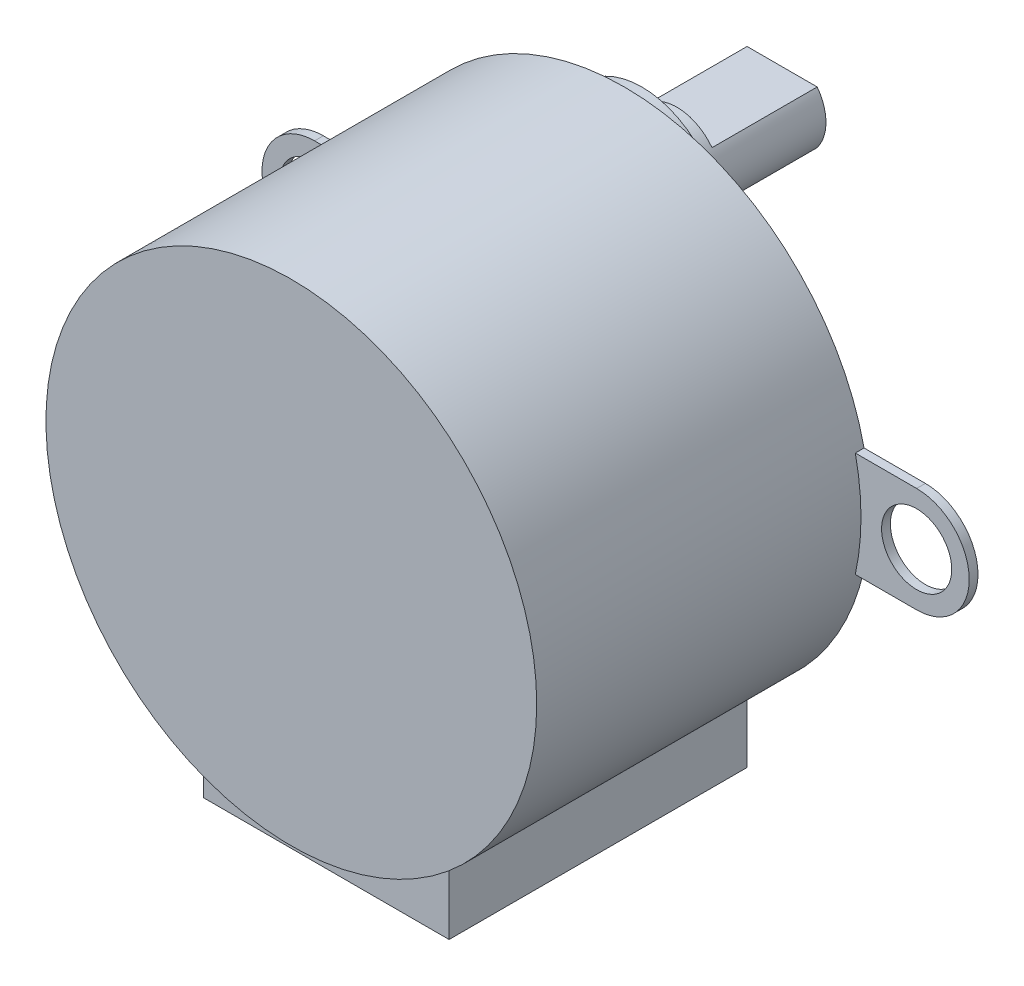
ISO-10303-21;
HEADER;
FILE_DESCRIPTION(('STEP AP214'),'2;1');
FILE_NAME('part.step','',(''),(''),'','','');
FILE_SCHEMA(('AUTOMOTIVE_DESIGN { 1 0 10303 214 1 1 1 1 }'));
ENDSEC;
DATA;
#1=APPLICATION_CONTEXT('core data for automotive mechanical design processes');
#2=APPLICATION_PROTOCOL_DEFINITION('international standard','automotive_design',2000,#1);
#3=PRODUCT_CONTEXT('',#1,'mechanical');
#4=PRODUCT('Part','Part','',(#3));
#5=PRODUCT_RELATED_PRODUCT_CATEGORY('part','',(#4));
#6=PRODUCT_DEFINITION_FORMATION('','',#4);
#7=PRODUCT_DEFINITION_CONTEXT('part definition',#1,'design');
#8=PRODUCT_DEFINITION('design','',#6,#7);
#9=PRODUCT_DEFINITION_SHAPE('','',#8);
#10=(LENGTH_UNIT() NAMED_UNIT(*) SI_UNIT(.MILLI.,.METRE.));
#11=(NAMED_UNIT(*) PLANE_ANGLE_UNIT() SI_UNIT($,.RADIAN.));
#12=(NAMED_UNIT(*) SI_UNIT($,.STERADIAN.) SOLID_ANGLE_UNIT());
#13=UNCERTAINTY_MEASURE_WITH_UNIT(LENGTH_MEASURE(1.E-05),#10,'distance_accuracy_value','');
#14=(GEOMETRIC_REPRESENTATION_CONTEXT(3) GLOBAL_UNCERTAINTY_ASSIGNED_CONTEXT((#13)) GLOBAL_UNIT_ASSIGNED_CONTEXT((#10,
#11,#12)) REPRESENTATION_CONTEXT('',''));
#15=CARTESIAN_POINT('',(0.,0.,0.));
#16=DIRECTION('',(0.,0.,1.));
#17=DIRECTION('',(1.,0.,0.));
#18=AXIS2_PLACEMENT_3D('',#15,#16,#17);
#19=CARTESIAN_POINT('',(0.,9.,-3.));
#20=DIRECTION('',(0.,0.,-1.));
#21=DIRECTION('',(-1.,0.,0.));
#22=AXIS2_PLACEMENT_3D('',#19,#20,#21);
#23=PLANE('',#22);
#24=DIRECTION('',(1.,0.,0.));
#25=VECTOR('',#24,1.);
#26=CARTESIAN_POINT('',(2.,10.5,-3.));
#27=LINE('',#26,#25);
#28=CARTESIAN_POINT('',(-2.,10.5,-3.));
#29=VERTEX_POINT('',#28);
#30=CARTESIAN_POINT('',(2.,10.5,-3.));
#31=VERTEX_POINT('',#30);
#32=EDGE_CURVE('E188',#29,#31,#27,.T.);
#33=ORIENTED_EDGE('',*,*,#32,.F.);
#34=CARTESIAN_POINT('',(0.,9.,-3.));
#35=DIRECTION('',(0.,0.,-1.));
#36=DIRECTION('',(-1.,0.,0.));
#37=AXIS2_PLACEMENT_3D('',#34,#35,#36);
#38=CIRCLE('',#37,2.5);
#39=EDGE_CURVE('E211',#29,#31,#38,.T.);
#40=ORIENTED_EDGE('',*,*,#39,.T.);
#41=EDGE_LOOP('',(#33,#40));
#42=FACE_BOUND('',#41,.T.);
#43=ADVANCED_FACE('F39',(#42),#23,.T.);
#44=CARTESIAN_POINT('',(0.,0.,19.));
#45=DIRECTION('',(0.,0.,-1.));
#46=DIRECTION('',(-1.,0.,0.));
#47=AXIS2_PLACEMENT_3D('',#44,#45,#46);
#48=CYLINDRICAL_SURFACE('',#47,14.);
#49=CARTESIAN_POINT('',(0.,0.,19.));
#50=DIRECTION('',(0.,0.,1.));
#51=DIRECTION('',(1.,0.,0.));
#52=AXIS2_PLACEMENT_3D('',#49,#50,#51);
#53=CIRCLE('',#52,14.);
#54=CARTESIAN_POINT('',(14.,0.,19.));
#55=VERTEX_POINT('',#54);
#56=EDGE_CURVE('E292',#55,#55,#53,.T.);
#57=ORIENTED_EDGE('',*,*,#56,.F.);
#58=EDGE_LOOP('',(#57));
#59=FACE_BOUND('',#58,.T.);
#60=CARTESIAN_POINT('',(0.,0.,17.));
#61=DIRECTION('',(0.,0.,1.));
#62=DIRECTION('',(1.,0.,0.));
#63=AXIS2_PLACEMENT_3D('',#60,#61,#62);
#64=CIRCLE('',#63,14.);
#65=CARTESIAN_POINT('',(-7.,-12.1243556529821,17.));
#66=VERTEX_POINT('',#65);
#67=CARTESIAN_POINT('',(7.,-12.1243556529821,17.));
#68=VERTEX_POINT('',#67);
#69=EDGE_CURVE('E11',#66,#68,#64,.T.);
#70=ORIENTED_EDGE('',*,*,#69,.T.);
#71=DIRECTION('',(0.,0.,-1.));
#72=VECTOR('',#71,1.);
#73=CARTESIAN_POINT('',(7.,-12.1243556529821,17.));
#74=LINE('',#73,#72);
#75=CARTESIAN_POINT('',(7.,-12.1243556529821,0.));
#76=VERTEX_POINT('',#75);
#77=EDGE_CURVE('E170',#68,#76,#74,.T.);
#78=ORIENTED_EDGE('',*,*,#77,.T.);
#79=CARTESIAN_POINT('',(0.,0.,0.));
#80=DIRECTION('',(0.,0.,1.));
#81=DIRECTION('',(1.,0.,0.));
#82=AXIS2_PLACEMENT_3D('',#79,#80,#81);
#83=CIRCLE('',#82,14.);
#84=CARTESIAN_POINT('',(13.6747943311773,-3.,0.));
#85=VERTEX_POINT('',#84);
#86=EDGE_CURVE('E296',#76,#85,#83,.T.);
#87=ORIENTED_EDGE('',*,*,#86,.T.);
#88=DIRECTION('',(0.,0.,-1.));
#89=VECTOR('',#88,1.);
#90=CARTESIAN_POINT('',(13.6747943311773,-3.,0.5));
#91=LINE('',#90,#89);
#92=CARTESIAN_POINT('',(13.6747943311773,-3.,0.5));
#93=VERTEX_POINT('',#92);
#94=EDGE_CURVE('E252',#93,#85,#91,.T.);
#95=ORIENTED_EDGE('',*,*,#94,.F.);
#96=CARTESIAN_POINT('',(0.,0.,0.5));
#97=DIRECTION('',(0.,0.,1.));
#98=DIRECTION('',(-1.,0.,0.));
#99=AXIS2_PLACEMENT_3D('',#96,#97,#98);
#100=CIRCLE('',#99,14.);
#101=CARTESIAN_POINT('',(13.6747943311773,3.,0.5));
#102=VERTEX_POINT('',#101);
#103=EDGE_CURVE('E233',#93,#102,#100,.T.);
#104=ORIENTED_EDGE('',*,*,#103,.T.);
#105=DIRECTION('',(0.,0.,-1.));
#106=VECTOR('',#105,1.);
#107=CARTESIAN_POINT('',(13.6747943311773,3.,0.5));
#108=LINE('',#107,#106);
#109=CARTESIAN_POINT('',(13.6747943311773,3.,0.));
#110=VERTEX_POINT('',#109);
#111=EDGE_CURVE('E249',#102,#110,#108,.T.);
#112=ORIENTED_EDGE('',*,*,#111,.T.);
#113=CARTESIAN_POINT('',(-13.6747943311773,3.,0.));
#114=VERTEX_POINT('',#113);
#115=EDGE_CURVE('E284',#110,#114,#83,.T.);
#116=ORIENTED_EDGE('',*,*,#115,.T.);
#117=DIRECTION('',(0.,0.,-1.));
#118=VECTOR('',#117,1.);
#119=CARTESIAN_POINT('',(-13.6747943311773,3.,0.5));
#120=LINE('',#119,#118);
#121=CARTESIAN_POINT('',(-13.6747943311773,3.,0.5));
#122=VERTEX_POINT('',#121);
#123=EDGE_CURVE('E288',#122,#114,#120,.T.);
#124=ORIENTED_EDGE('',*,*,#123,.F.);
#125=CARTESIAN_POINT('',(0.,0.,0.5));
#126=DIRECTION('',(0.,0.,1.));
#127=DIRECTION('',(-1.,0.,0.));
#128=AXIS2_PLACEMENT_3D('',#125,#126,#127);
#129=CIRCLE('',#128,14.);
#130=CARTESIAN_POINT('',(-13.6747943311773,-3.,0.5));
#131=VERTEX_POINT('',#130);
#132=EDGE_CURVE('E269',#122,#131,#129,.T.);
#133=ORIENTED_EDGE('',*,*,#132,.T.);
#134=DIRECTION('',(0.,0.,-1.));
#135=VECTOR('',#134,1.);
#136=CARTESIAN_POINT('',(-13.6747943311773,-3.00000000000001,0.5));
#137=LINE('',#136,#135);
#138=CARTESIAN_POINT('',(-13.6747943311773,-3.00000000000001,0.));
#139=VERTEX_POINT('',#138);
#140=EDGE_CURVE('E285',#131,#139,#137,.T.);
#141=ORIENTED_EDGE('',*,*,#140,.T.);
#142=CARTESIAN_POINT('',(-7.,-12.1243556529821,0.));
#143=VERTEX_POINT('',#142);
#144=EDGE_CURVE('E295',#139,#143,#83,.T.);
#145=ORIENTED_EDGE('',*,*,#144,.T.);
#146=DIRECTION('',(0.,0.,-1.));
#147=VECTOR('',#146,1.);
#148=CARTESIAN_POINT('',(-7.,-12.1243556529821,17.));
#149=LINE('',#148,#147);
#150=EDGE_CURVE('E57',#66,#143,#149,.T.);
#151=ORIENTED_EDGE('',*,*,#150,.F.);
#152=EDGE_LOOP('',(#70,#78,#87,#95,#104,#112,#116,#124,#133,#141,#145,#151));
#153=FACE_BOUND('',#152,.T.);
#154=ADVANCED_FACE('F41',(#59,#153),#48,.T.);
#155=CARTESIAN_POINT('',(0.,0.,19.));
#156=DIRECTION('',(0.,0.,1.));
#157=DIRECTION('',(1.,0.,0.));
#158=AXIS2_PLACEMENT_3D('',#155,#156,#157);
#159=PLANE('',#158);
#160=ORIENTED_EDGE('',*,*,#56,.T.);
#161=EDGE_LOOP('',(#160));
#162=FACE_BOUND('',#161,.T.);
#163=ADVANCED_FACE('F306',(#162),#159,.T.);
#164=CARTESIAN_POINT('',(0.,0.,0.));
#165=DIRECTION('',(0.,0.,1.));
#166=DIRECTION('',(1.,0.,0.));
#167=AXIS2_PLACEMENT_3D('',#164,#165,#166);
#168=PLANE('',#167);
#169=CARTESIAN_POINT('',(0.,9.,0.));
#170=DIRECTION('',(0.,0.,1.));
#171=DIRECTION('',(1.,0.,0.));
#172=AXIS2_PLACEMENT_3D('',#169,#170,#171);
#173=CIRCLE('',#172,4.5);
#174=CARTESIAN_POINT('',(4.5,9.,0.));
#175=VERTEX_POINT('',#174);
#176=EDGE_CURVE('E216',#175,#175,#173,.F.);
#177=ORIENTED_EDGE('',*,*,#176,.F.);
#178=EDGE_LOOP('',(#177));
#179=FACE_BOUND('',#178,.T.);
#180=ORIENTED_EDGE('',*,*,#86,.F.);
#181=DIRECTION('',(0.,-1.,0.));
#182=VECTOR('',#181,1.);
#183=CARTESIAN_POINT('',(7.,-16.1243556529821,0.));
#184=LINE('',#183,#182);
#185=CARTESIAN_POINT('',(7.,-16.1243556529821,0.));
#186=VERTEX_POINT('',#185);
#187=EDGE_CURVE('E177',#76,#186,#184,.T.);
#188=ORIENTED_EDGE('',*,*,#187,.T.);
#189=DIRECTION('',(-1.,0.,0.));
#190=VECTOR('',#189,1.);
#191=CARTESIAN_POINT('',(7.,-16.1243556529821,0.));
#192=LINE('',#191,#190);
#193=CARTESIAN_POINT('',(-7.,-16.1243556529821,0.));
#194=VERTEX_POINT('',#193);
#195=EDGE_CURVE('E154',#186,#194,#192,.T.);
#196=ORIENTED_EDGE('',*,*,#195,.T.);
#197=DIRECTION('',(0.,1.,0.));
#198=VECTOR('',#197,1.);
#199=CARTESIAN_POINT('',(-7.,-16.1243556529821,0.));
#200=LINE('',#199,#198);
#201=EDGE_CURVE('E171',#194,#143,#200,.T.);
#202=ORIENTED_EDGE('',*,*,#201,.T.);
#203=ORIENTED_EDGE('',*,*,#144,.F.);
#204=DIRECTION('',(-1.,0.,0.));
#205=VECTOR('',#204,1.);
#206=CARTESIAN_POINT('',(-17.1747943311773,-3.,0.));
#207=LINE('',#206,#205);
#208=CARTESIAN_POINT('',(-17.1747943311773,-3.,0.));
#209=VERTEX_POINT('',#208);
#210=EDGE_CURVE('E266',#139,#209,#207,.T.);
#211=ORIENTED_EDGE('',*,*,#210,.T.);
#212=CARTESIAN_POINT('',(-17.1747943311773,0.,0.));
#213=DIRECTION('',(0.,0.,-1.));
#214=DIRECTION('',(-1.,0.,0.));
#215=AXIS2_PLACEMENT_3D('',#212,#213,#214);
#216=CIRCLE('',#215,3.);
#217=CARTESIAN_POINT('',(-17.1747943311773,3.,0.));
#218=VERTEX_POINT('',#217);
#219=EDGE_CURVE('E259',#209,#218,#216,.T.);
#220=ORIENTED_EDGE('',*,*,#219,.T.);
#221=DIRECTION('',(1.,0.,0.));
#222=VECTOR('',#221,1.);
#223=CARTESIAN_POINT('',(-17.1747943311773,3.,0.));
#224=LINE('',#223,#222);
#225=EDGE_CURVE('E277',#218,#114,#224,.T.);
#226=ORIENTED_EDGE('',*,*,#225,.T.);
#227=ORIENTED_EDGE('',*,*,#115,.F.);
#228=DIRECTION('',(1.,0.,0.));
#229=VECTOR('',#228,1.);
#230=CARTESIAN_POINT('',(17.1747943311773,3.,0.));
#231=LINE('',#230,#229);
#232=CARTESIAN_POINT('',(17.1747943311773,3.,0.));
#233=VERTEX_POINT('',#232);
#234=EDGE_CURVE('E230',#110,#233,#231,.T.);
#235=ORIENTED_EDGE('',*,*,#234,.T.);
#236=CARTESIAN_POINT('',(17.1747943311773,0.,0.));
#237=DIRECTION('',(0.,0.,-1.));
#238=DIRECTION('',(1.,0.,0.));
#239=AXIS2_PLACEMENT_3D('',#236,#237,#238);
#240=CIRCLE('',#239,3.);
#241=CARTESIAN_POINT('',(17.1747943311773,-3.,0.));
#242=VERTEX_POINT('',#241);
#243=EDGE_CURVE('E223',#233,#242,#240,.T.);
#244=ORIENTED_EDGE('',*,*,#243,.T.);
#245=DIRECTION('',(-1.,0.,0.));
#246=VECTOR('',#245,1.);
#247=CARTESIAN_POINT('',(17.1747943311773,-3.,0.));
#248=LINE('',#247,#246);
#249=EDGE_CURVE('E241',#242,#85,#248,.T.);
#250=ORIENTED_EDGE('',*,*,#249,.T.);
#251=EDGE_LOOP('',(#180,#188,#196,#202,#203,#211,#220,#226,#227,#235,#244,#250));
#252=FACE_BOUND('',#251,.T.);
#253=CARTESIAN_POINT('',(-17.1747943311773,0.,0.));
#254=DIRECTION('',(0.,0.,-1.));
#255=DIRECTION('',(-1.,0.,0.));
#256=AXIS2_PLACEMENT_3D('',#253,#254,#255);
#257=CIRCLE('',#256,2.);
#258=CARTESIAN_POINT('',(-19.1747943311773,0.,0.));
#259=VERTEX_POINT('',#258);
#260=EDGE_CURVE('E248',#259,#259,#257,.T.);
#261=ORIENTED_EDGE('',*,*,#260,.F.);
#262=EDGE_LOOP('',(#261));
#263=FACE_BOUND('',#262,.T.);
#264=CARTESIAN_POINT('',(17.1747943311773,0.,0.));
#265=DIRECTION('',(0.,0.,-1.));
#266=DIRECTION('',(1.,0.,0.));
#267=AXIS2_PLACEMENT_3D('',#264,#265,#266);
#268=CIRCLE('',#267,2.);
#269=CARTESIAN_POINT('',(19.1747943311773,0.,0.));
#270=VERTEX_POINT('',#269);
#271=EDGE_CURVE('E219',#270,#270,#268,.T.);
#272=ORIENTED_EDGE('',*,*,#271,.F.);
#273=EDGE_LOOP('',(#272));
#274=FACE_BOUND('',#273,.T.);
#275=ADVANCED_FACE('F302',(#179,#252,#263,#274),#168,.F.);
#276=CARTESIAN_POINT('',(-17.1747943311773,0.,0.5));
#277=DIRECTION('',(0.,0.,-1.));
#278=DIRECTION('',(-1.,0.,0.));
#279=AXIS2_PLACEMENT_3D('',#276,#277,#278);
#280=CYLINDRICAL_SURFACE('',#279,3.);
#281=ORIENTED_EDGE('',*,*,#219,.F.);
#282=DIRECTION('',(0.,0.,-1.));
#283=VECTOR('',#282,1.);
#284=CARTESIAN_POINT('',(-17.1747943311773,-3.,0.5));
#285=LINE('',#284,#283);
#286=CARTESIAN_POINT('',(-17.1747943311773,-3.,0.5));
#287=VERTEX_POINT('',#286);
#288=EDGE_CURVE('E282',#287,#209,#285,.T.);
#289=ORIENTED_EDGE('',*,*,#288,.F.);
#290=CARTESIAN_POINT('',(-17.1747943311773,0.,0.5));
#291=DIRECTION('',(0.,0.,-1.));
#292=DIRECTION('',(-1.,0.,0.));
#293=AXIS2_PLACEMENT_3D('',#290,#291,#292);
#294=CIRCLE('',#293,3.);
#295=CARTESIAN_POINT('',(-17.1747943311773,3.,0.5));
#296=VERTEX_POINT('',#295);
#297=EDGE_CURVE('E262',#287,#296,#294,.T.);
#298=ORIENTED_EDGE('',*,*,#297,.T.);
#299=DIRECTION('',(0.,0.,-1.));
#300=VECTOR('',#299,1.);
#301=CARTESIAN_POINT('',(-17.1747943311773,3.,0.5));
#302=LINE('',#301,#300);
#303=EDGE_CURVE('E274',#296,#218,#302,.T.);
#304=ORIENTED_EDGE('',*,*,#303,.T.);
#305=EDGE_LOOP('',(#281,#289,#298,#304));
#306=FACE_BOUND('',#305,.T.);
#307=ADVANCED_FACE('F305',(#306),#280,.T.);
#308=CARTESIAN_POINT('',(-17.1747943311773,-3.,0.5));
#309=DIRECTION('',(0.,-1.,0.));
#310=DIRECTION('',(1.,0.,0.));
#311=AXIS2_PLACEMENT_3D('',#308,#309,#310);
#312=PLANE('',#311);
#313=ORIENTED_EDGE('',*,*,#210,.F.);
#314=ORIENTED_EDGE('',*,*,#140,.F.);
#315=DIRECTION('',(-1.,0.,0.));
#316=VECTOR('',#315,1.);
#317=CARTESIAN_POINT('',(-17.1747943311773,-3.,0.5));
#318=LINE('',#317,#316);
#319=EDGE_CURVE('E271',#131,#287,#318,.T.);
#320=ORIENTED_EDGE('',*,*,#319,.T.);
#321=ORIENTED_EDGE('',*,*,#288,.T.);
#322=EDGE_LOOP('',(#313,#314,#320,#321));
#323=FACE_BOUND('',#322,.T.);
#324=ADVANCED_FACE('F490',(#323),#312,.T.);
#325=CARTESIAN_POINT('',(-17.1747943311773,3.,0.5));
#326=DIRECTION('',(0.,1.,0.));
#327=DIRECTION('',(-1.,0.,0.));
#328=AXIS2_PLACEMENT_3D('',#325,#326,#327);
#329=PLANE('',#328);
#330=ORIENTED_EDGE('',*,*,#225,.F.);
#331=ORIENTED_EDGE('',*,*,#303,.F.);
#332=DIRECTION('',(1.,0.,0.));
#333=VECTOR('',#332,1.);
#334=CARTESIAN_POINT('',(-17.1747943311773,3.,0.5));
#335=LINE('',#334,#333);
#336=EDGE_CURVE('E265',#296,#122,#335,.T.);
#337=ORIENTED_EDGE('',*,*,#336,.T.);
#338=ORIENTED_EDGE('',*,*,#123,.T.);
#339=EDGE_LOOP('',(#330,#331,#337,#338));
#340=FACE_BOUND('',#339,.T.);
#341=ADVANCED_FACE('F482',(#340),#329,.T.);
#342=CARTESIAN_POINT('',(-17.1747943311773,0.,0.5));
#343=DIRECTION('',(0.,0.,-1.));
#344=DIRECTION('',(-1.,0.,0.));
#345=AXIS2_PLACEMENT_3D('',#342,#343,#344);
#346=PLANE('',#345);
#347=CARTESIAN_POINT('',(-17.1747943311773,0.,0.5));
#348=DIRECTION('',(0.,0.,-1.));
#349=DIRECTION('',(-1.,0.,0.));
#350=AXIS2_PLACEMENT_3D('',#347,#348,#349);
#351=CIRCLE('',#350,2.);
#352=CARTESIAN_POINT('',(-19.1747943311773,0.,0.5));
#353=VERTEX_POINT('',#352);
#354=EDGE_CURVE('E256',#353,#353,#351,.T.);
#355=ORIENTED_EDGE('',*,*,#354,.T.);
#356=EDGE_LOOP('',(#355));
#357=FACE_BOUND('',#356,.T.);
#358=ORIENTED_EDGE('',*,*,#297,.F.);
#359=ORIENTED_EDGE('',*,*,#319,.F.);
#360=ORIENTED_EDGE('',*,*,#132,.F.);
#361=ORIENTED_EDGE('',*,*,#336,.F.);
#362=EDGE_LOOP('',(#358,#359,#360,#361));
#363=FACE_BOUND('',#362,.T.);
#364=ADVANCED_FACE('F474',(#357,#363),#346,.F.);
#365=CARTESIAN_POINT('',(-17.1747943311773,0.,0.5));
#366=DIRECTION('',(0.,0.,-1.));
#367=DIRECTION('',(-1.,0.,0.));
#368=AXIS2_PLACEMENT_3D('',#365,#366,#367);
#369=CYLINDRICAL_SURFACE('',#368,2.);
#370=ORIENTED_EDGE('',*,*,#354,.F.);
#371=EDGE_LOOP('',(#370));
#372=FACE_BOUND('',#371,.T.);
#373=ORIENTED_EDGE('',*,*,#260,.T.);
#374=EDGE_LOOP('',(#373));
#375=FACE_BOUND('',#374,.T.);
#376=ADVANCED_FACE('F466',(#372,#375),#369,.F.);
#377=CARTESIAN_POINT('',(17.1747943311773,0.,0.5));
#378=DIRECTION('',(0.,0.,-1.));
#379=DIRECTION('',(-1.,0.,0.));
#380=AXIS2_PLACEMENT_3D('',#377,#378,#379);
#381=CYLINDRICAL_SURFACE('',#380,3.);
#382=ORIENTED_EDGE('',*,*,#243,.F.);
#383=DIRECTION('',(0.,0.,-1.));
#384=VECTOR('',#383,1.);
#385=CARTESIAN_POINT('',(17.1747943311773,3.,0.5));
#386=LINE('',#385,#384);
#387=CARTESIAN_POINT('',(17.1747943311773,3.,0.5));
#388=VERTEX_POINT('',#387);
#389=EDGE_CURVE('E246',#388,#233,#386,.T.);
#390=ORIENTED_EDGE('',*,*,#389,.F.);
#391=CARTESIAN_POINT('',(17.1747943311773,0.,0.5));
#392=DIRECTION('',(0.,0.,-1.));
#393=DIRECTION('',(1.,0.,0.));
#394=AXIS2_PLACEMENT_3D('',#391,#392,#393);
#395=CIRCLE('',#394,3.);
#396=CARTESIAN_POINT('',(17.1747943311773,-3.,0.5));
#397=VERTEX_POINT('',#396);
#398=EDGE_CURVE('E226',#388,#397,#395,.T.);
#399=ORIENTED_EDGE('',*,*,#398,.T.);
#400=DIRECTION('',(0.,0.,-1.));
#401=VECTOR('',#400,1.);
#402=CARTESIAN_POINT('',(17.1747943311773,-3.,0.5));
#403=LINE('',#402,#401);
#404=EDGE_CURVE('E238',#397,#242,#403,.T.);
#405=ORIENTED_EDGE('',*,*,#404,.T.);
#406=EDGE_LOOP('',(#382,#390,#399,#405));
#407=FACE_BOUND('',#406,.T.);
#408=ADVANCED_FACE('F458',(#407),#381,.T.);
#409=CARTESIAN_POINT('',(17.1747943311773,3.,0.5));
#410=DIRECTION('',(0.,1.,0.));
#411=DIRECTION('',(-1.,0.,0.));
#412=AXIS2_PLACEMENT_3D('',#409,#410,#411);
#413=PLANE('',#412);
#414=ORIENTED_EDGE('',*,*,#234,.F.);
#415=ORIENTED_EDGE('',*,*,#111,.F.);
#416=DIRECTION('',(1.,0.,0.));
#417=VECTOR('',#416,1.);
#418=CARTESIAN_POINT('',(17.1747943311773,3.,0.5));
#419=LINE('',#418,#417);
#420=EDGE_CURVE('E235',#102,#388,#419,.T.);
#421=ORIENTED_EDGE('',*,*,#420,.T.);
#422=ORIENTED_EDGE('',*,*,#389,.T.);
#423=EDGE_LOOP('',(#414,#415,#421,#422));
#424=FACE_BOUND('',#423,.T.);
#425=ADVANCED_FACE('F450',(#424),#413,.T.);
#426=CARTESIAN_POINT('',(17.1747943311773,-3.,0.5));
#427=DIRECTION('',(0.,-1.,0.));
#428=DIRECTION('',(1.,0.,0.));
#429=AXIS2_PLACEMENT_3D('',#426,#427,#428);
#430=PLANE('',#429);
#431=ORIENTED_EDGE('',*,*,#249,.F.);
#432=ORIENTED_EDGE('',*,*,#404,.F.);
#433=DIRECTION('',(-1.,0.,0.));
#434=VECTOR('',#433,1.);
#435=CARTESIAN_POINT('',(17.1747943311773,-3.,0.5));
#436=LINE('',#435,#434);
#437=EDGE_CURVE('E229',#397,#93,#436,.T.);
#438=ORIENTED_EDGE('',*,*,#437,.T.);
#439=ORIENTED_EDGE('',*,*,#94,.T.);
#440=EDGE_LOOP('',(#431,#432,#438,#439));
#441=FACE_BOUND('',#440,.T.);
#442=ADVANCED_FACE('F324',(#441),#430,.T.);
#443=CARTESIAN_POINT('',(17.1747943311773,0.,0.5));
#444=DIRECTION('',(0.,0.,1.));
#445=DIRECTION('',(1.,0.,0.));
#446=AXIS2_PLACEMENT_3D('',#443,#444,#445);
#447=PLANE('',#446);
#448=CARTESIAN_POINT('',(17.1747943311773,0.,0.5));
#449=DIRECTION('',(0.,0.,-1.));
#450=DIRECTION('',(1.,0.,0.));
#451=AXIS2_PLACEMENT_3D('',#448,#449,#450);
#452=CIRCLE('',#451,2.);
#453=CARTESIAN_POINT('',(19.1747943311773,0.,0.5));
#454=VERTEX_POINT('',#453);
#455=EDGE_CURVE('E220',#454,#454,#452,.T.);
#456=ORIENTED_EDGE('',*,*,#455,.T.);
#457=EDGE_LOOP('',(#456));
#458=FACE_BOUND('',#457,.T.);
#459=ORIENTED_EDGE('',*,*,#398,.F.);
#460=ORIENTED_EDGE('',*,*,#420,.F.);
#461=ORIENTED_EDGE('',*,*,#103,.F.);
#462=ORIENTED_EDGE('',*,*,#437,.F.);
#463=EDGE_LOOP('',(#459,#460,#461,#462));
#464=FACE_BOUND('',#463,.T.);
#465=ADVANCED_FACE('F314',(#458,#464),#447,.T.);
#466=CARTESIAN_POINT('',(17.1747943311773,0.,0.5));
#467=DIRECTION('',(0.,0.,-1.));
#468=DIRECTION('',(-1.,0.,0.));
#469=AXIS2_PLACEMENT_3D('',#466,#467,#468);
#470=CYLINDRICAL_SURFACE('',#469,2.);
#471=ORIENTED_EDGE('',*,*,#455,.F.);
#472=EDGE_LOOP('',(#471));
#473=FACE_BOUND('',#472,.T.);
#474=ORIENTED_EDGE('',*,*,#271,.T.);
#475=EDGE_LOOP('',(#474));
#476=FACE_BOUND('',#475,.T.);
#477=ADVANCED_FACE('F312',(#473,#476),#470,.F.);
#478=CARTESIAN_POINT('',(0.,9.,-1.));
#479=DIRECTION('',(0.,0.,1.));
#480=DIRECTION('',(1.,0.,0.));
#481=AXIS2_PLACEMENT_3D('',#478,#479,#480);
#482=CYLINDRICAL_SURFACE('',#481,4.5);
#483=CARTESIAN_POINT('',(0.,9.,-1.));
#484=DIRECTION('',(0.,0.,-1.));
#485=DIRECTION('',(-1.,0.,0.));
#486=AXIS2_PLACEMENT_3D('',#483,#484,#485);
#487=CIRCLE('',#486,4.5);
#488=CARTESIAN_POINT('',(-4.5,9.,-1.));
#489=VERTEX_POINT('',#488);
#490=EDGE_CURVE('E213',#489,#489,#487,.T.);
#491=ORIENTED_EDGE('',*,*,#490,.F.);
#492=EDGE_LOOP('',(#491));
#493=FACE_BOUND('',#492,.T.);
#494=ORIENTED_EDGE('',*,*,#176,.T.);
#495=EDGE_LOOP('',(#494));
#496=FACE_BOUND('',#495,.T.);
#497=ADVANCED_FACE('F300',(#493,#496),#482,.T.);
#498=CARTESIAN_POINT('',(0.,9.,-1.));
#499=DIRECTION('',(0.,0.,-1.));
#500=DIRECTION('',(-1.,0.,0.));
#501=AXIS2_PLACEMENT_3D('',#498,#499,#500);
#502=PLANE('',#501);
#503=CARTESIAN_POINT('',(0.,9.,-1.));
#504=DIRECTION('',(0.,0.,-1.));
#505=DIRECTION('',(-1.,0.,0.));
#506=AXIS2_PLACEMENT_3D('',#503,#504,#505);
#507=CIRCLE('',#506,2.5);
#508=CARTESIAN_POINT('',(-2.5,9.,-1.));
#509=VERTEX_POINT('',#508);
#510=EDGE_CURVE('E47',#509,#509,#507,.T.);
#511=ORIENTED_EDGE('',*,*,#510,.F.);
#512=EDGE_LOOP('',(#511));
#513=FACE_BOUND('',#512,.T.);
#514=ORIENTED_EDGE('',*,*,#490,.T.);
#515=EDGE_LOOP('',(#514));
#516=FACE_BOUND('',#515,.T.);
#517=ADVANCED_FACE('F321',(#513,#516),#502,.T.);
#518=CARTESIAN_POINT('',(0.,9.,-3.));
#519=DIRECTION('',(0.,0.,1.));
#520=DIRECTION('',(1.,0.,0.));
#521=AXIS2_PLACEMENT_3D('',#518,#519,#520);
#522=CYLINDRICAL_SURFACE('',#521,2.5);
#523=ORIENTED_EDGE('',*,*,#39,.F.);
#524=DIRECTION('',(0.,0.,1.));
#525=VECTOR('',#524,1.);
#526=CARTESIAN_POINT('',(-2.,10.5,-9.));
#527=LINE('',#526,#525);
#528=CARTESIAN_POINT('',(-2.,10.5,-9.));
#529=VERTEX_POINT('',#528);
#530=EDGE_CURVE('E201',#529,#29,#527,.T.);
#531=ORIENTED_EDGE('',*,*,#530,.F.);
#532=CARTESIAN_POINT('',(0.,9.,-9.));
#533=DIRECTION('',(0.,0.,-1.));
#534=DIRECTION('',(-1.,0.,0.));
#535=AXIS2_PLACEMENT_3D('',#532,#533,#534);
#536=CIRCLE('',#535,2.5);
#537=CARTESIAN_POINT('',(-2.,7.5,-9.));
#538=VERTEX_POINT('',#537);
#539=EDGE_CURVE('E190',#538,#529,#536,.T.);
#540=ORIENTED_EDGE('',*,*,#539,.F.);
#541=DIRECTION('',(0.,0.,1.));
#542=VECTOR('',#541,1.);
#543=CARTESIAN_POINT('',(-2.,7.5,-9.));
#544=LINE('',#543,#542);
#545=CARTESIAN_POINT('',(-2.,7.5,-3.));
#546=VERTEX_POINT('',#545);
#547=EDGE_CURVE('E204',#538,#546,#544,.T.);
#548=ORIENTED_EDGE('',*,*,#547,.T.);
#549=CARTESIAN_POINT('',(2.,7.5,-3.));
#550=VERTEX_POINT('',#549);
#551=EDGE_CURVE('E210',#550,#546,#38,.T.);
#552=ORIENTED_EDGE('',*,*,#551,.F.);
#553=DIRECTION('',(0.,0.,1.));
#554=VECTOR('',#553,1.);
#555=CARTESIAN_POINT('',(2.,7.5,-9.));
#556=LINE('',#555,#554);
#557=CARTESIAN_POINT('',(2.,7.5,-9.));
#558=VERTEX_POINT('',#557);
#559=EDGE_CURVE('E207',#558,#550,#556,.T.);
#560=ORIENTED_EDGE('',*,*,#559,.F.);
#561=CARTESIAN_POINT('',(0.,9.,-9.));
#562=DIRECTION('',(0.,0.,-1.));
#563=DIRECTION('',(-1.,0.,0.));
#564=AXIS2_PLACEMENT_3D('',#561,#562,#563);
#565=CIRCLE('',#564,2.5);
#566=CARTESIAN_POINT('',(2.,10.5,-9.));
#567=VERTEX_POINT('',#566);
#568=EDGE_CURVE('E184',#567,#558,#565,.T.);
#569=ORIENTED_EDGE('',*,*,#568,.F.);
#570=DIRECTION('',(0.,0.,1.));
#571=VECTOR('',#570,1.);
#572=CARTESIAN_POINT('',(2.,10.5,-9.));
#573=LINE('',#572,#571);
#574=EDGE_CURVE('E194',#567,#31,#573,.T.);
#575=ORIENTED_EDGE('',*,*,#574,.T.);
#576=EDGE_LOOP('',(#523,#531,#540,#548,#552,#560,#569,#575));
#577=FACE_BOUND('',#576,.T.);
#578=ORIENTED_EDGE('',*,*,#510,.T.);
#579=EDGE_LOOP('',(#578));
#580=FACE_BOUND('',#579,.T.);
#581=ADVANCED_FACE('F342',(#577,#580),#522,.T.);
#582=DIRECTION('',(-1.,0.,0.));
#583=VECTOR('',#582,1.);
#584=CARTESIAN_POINT('',(2.,7.5,-3.));
#585=LINE('',#584,#583);
#586=EDGE_CURVE('E181',#550,#546,#585,.T.);
#587=ORIENTED_EDGE('',*,*,#586,.F.);
#588=ORIENTED_EDGE('',*,*,#551,.T.);
#589=EDGE_LOOP('',(#587,#588));
#590=FACE_BOUND('',#589,.T.);
#591=ADVANCED_FACE('F331',(#590),#23,.T.);
#592=CARTESIAN_POINT('',(2.,7.5,-9.));
#593=DIRECTION('',(0.,1.,0.));
#594=DIRECTION('',(0.,0.,1.));
#595=AXIS2_PLACEMENT_3D('',#592,#593,#594);
#596=PLANE('',#595);
#597=ORIENTED_EDGE('',*,*,#586,.T.);
#598=ORIENTED_EDGE('',*,*,#547,.F.);
#599=DIRECTION('',(-1.,0.,0.));
#600=VECTOR('',#599,1.);
#601=CARTESIAN_POINT('',(2.,7.5,-9.));
#602=LINE('',#601,#600);
#603=EDGE_CURVE('E187',#558,#538,#602,.T.);
#604=ORIENTED_EDGE('',*,*,#603,.F.);
#605=ORIENTED_EDGE('',*,*,#559,.T.);
#606=EDGE_LOOP('',(#597,#598,#604,#605));
#607=FACE_BOUND('',#606,.T.);
#608=ADVANCED_FACE('F341',(#607),#596,.F.);
#609=CARTESIAN_POINT('',(2.,10.5,-9.));
#610=DIRECTION('',(0.,-1.,0.));
#611=DIRECTION('',(0.,0.,-1.));
#612=AXIS2_PLACEMENT_3D('',#609,#610,#611);
#613=PLANE('',#612);
#614=ORIENTED_EDGE('',*,*,#32,.T.);
#615=ORIENTED_EDGE('',*,*,#574,.F.);
#616=DIRECTION('',(1.,0.,0.));
#617=VECTOR('',#616,1.);
#618=CARTESIAN_POINT('',(2.,10.5,-9.));
#619=LINE('',#618,#617);
#620=EDGE_CURVE('E192',#529,#567,#619,.T.);
#621=ORIENTED_EDGE('',*,*,#620,.F.);
#622=ORIENTED_EDGE('',*,*,#530,.T.);
#623=EDGE_LOOP('',(#614,#615,#621,#622));
#624=FACE_BOUND('',#623,.T.);
#625=ADVANCED_FACE('F347',(#624),#613,.F.);
#626=CARTESIAN_POINT('',(0.,9.,-9.));
#627=DIRECTION('',(0.,0.,-1.));
#628=DIRECTION('',(-1.,0.,0.));
#629=AXIS2_PLACEMENT_3D('',#626,#627,#628);
#630=PLANE('',#629);
#631=ORIENTED_EDGE('',*,*,#568,.T.);
#632=ORIENTED_EDGE('',*,*,#603,.T.);
#633=ORIENTED_EDGE('',*,*,#539,.T.);
#634=ORIENTED_EDGE('',*,*,#620,.T.);
#635=EDGE_LOOP('',(#631,#632,#633,#634));
#636=FACE_BOUND('',#635,.T.);
#637=ADVANCED_FACE('F358',(#636),#630,.T.);
#638=CARTESIAN_POINT('',(7.,-16.1243556529821,17.));
#639=DIRECTION('',(1.,0.,0.));
#640=DIRECTION('',(0.,0.,-1.));
#641=AXIS2_PLACEMENT_3D('',#638,#639,#640);
#642=PLANE('',#641);
#643=ORIENTED_EDGE('',*,*,#187,.F.);
#644=ORIENTED_EDGE('',*,*,#77,.F.);
#645=DIRECTION('',(0.,-1.,0.));
#646=VECTOR('',#645,1.);
#647=CARTESIAN_POINT('',(7.,-16.1243556529821,17.));
#648=LINE('',#647,#646);
#649=CARTESIAN_POINT('',(7.,-16.1243556529821,17.));
#650=VERTEX_POINT('',#649);
#651=EDGE_CURVE('E166',#68,#650,#648,.T.);
#652=ORIENTED_EDGE('',*,*,#651,.T.);
#653=DIRECTION('',(0.,0.,-1.));
#654=VECTOR('',#653,1.);
#655=CARTESIAN_POINT('',(7.,-16.1243556529821,17.));
#656=LINE('',#655,#654);
#657=EDGE_CURVE('E149',#650,#186,#656,.T.);
#658=ORIENTED_EDGE('',*,*,#657,.T.);
#659=EDGE_LOOP('',(#643,#644,#652,#658));
#660=FACE_BOUND('',#659,.T.);
#661=ADVANCED_FACE('F169',(#660),#642,.T.);
#662=CARTESIAN_POINT('',(-7.,-16.1243556529821,17.));
#663=DIRECTION('',(-1.,0.,0.));
#664=DIRECTION('',(0.,0.,1.));
#665=AXIS2_PLACEMENT_3D('',#662,#663,#664);
#666=PLANE('',#665);
#667=ORIENTED_EDGE('',*,*,#201,.F.);
#668=DIRECTION('',(0.,0.,-1.));
#669=VECTOR('',#668,1.);
#670=CARTESIAN_POINT('',(-7.,-16.1243556529821,17.));
#671=LINE('',#670,#669);
#672=CARTESIAN_POINT('',(-7.,-16.1243556529821,17.));
#673=VERTEX_POINT('',#672);
#674=EDGE_CURVE('E159',#673,#194,#671,.T.);
#675=ORIENTED_EDGE('',*,*,#674,.F.);
#676=DIRECTION('',(0.,1.,0.));
#677=VECTOR('',#676,1.);
#678=CARTESIAN_POINT('',(-7.,-16.1243556529821,17.));
#679=LINE('',#678,#677);
#680=EDGE_CURVE('E160',#673,#66,#679,.T.);
#681=ORIENTED_EDGE('',*,*,#680,.T.);
#682=ORIENTED_EDGE('',*,*,#150,.T.);
#683=EDGE_LOOP('',(#667,#675,#681,#682));
#684=FACE_BOUND('',#683,.T.);
#685=ADVANCED_FACE('F372',(#684),#666,.T.);
#686=CARTESIAN_POINT('',(7.,-16.1243556529821,17.));
#687=DIRECTION('',(0.,-1.,0.));
#688=DIRECTION('',(0.,0.,-1.));
#689=AXIS2_PLACEMENT_3D('',#686,#687,#688);
#690=PLANE('',#689);
#691=ORIENTED_EDGE('',*,*,#195,.F.);
#692=ORIENTED_EDGE('',*,*,#657,.F.);
#693=DIRECTION('',(-1.,0.,0.));
#694=VECTOR('',#693,1.);
#695=CARTESIAN_POINT('',(7.,-16.1243556529821,17.));
#696=LINE('',#695,#694);
#697=EDGE_CURVE('E152',#650,#673,#696,.T.);
#698=ORIENTED_EDGE('',*,*,#697,.T.);
#699=ORIENTED_EDGE('',*,*,#674,.T.);
#700=EDGE_LOOP('',(#691,#692,#698,#699));
#701=FACE_BOUND('',#700,.T.);
#702=ADVANCED_FACE('F151',(#701),#690,.T.);
#703=CARTESIAN_POINT('',(0.,0.,17.));
#704=DIRECTION('',(0.,0.,1.));
#705=DIRECTION('',(1.,0.,0.));
#706=AXIS2_PLACEMENT_3D('',#703,#704,#705);
#707=PLANE('',#706);
#708=ORIENTED_EDGE('',*,*,#69,.F.);
#709=ORIENTED_EDGE('',*,*,#680,.F.);
#710=ORIENTED_EDGE('',*,*,#697,.F.);
#711=ORIENTED_EDGE('',*,*,#651,.F.);
#712=EDGE_LOOP('',(#708,#709,#710,#711));
#713=FACE_BOUND('',#712,.T.);
#714=ADVANCED_FACE('F165',(#713),#707,.T.);
#715=CLOSED_SHELL('',(#43,#154,#163,#275,#307,#324,#341,#364,#376,#408,#425,#442,#465,#477,#497,
#517,#581,#591,#608,#625,#637,#661,#685,#702,#714));
#716=MANIFOLD_SOLID_BREP('B2',#715);
#717=ADVANCED_BREP_SHAPE_REPRESENTATION('',(#18,#716),#14);
#718=SHAPE_DEFINITION_REPRESENTATION(#9,#717);
ENDSEC;
END-ISO-10303-21;
